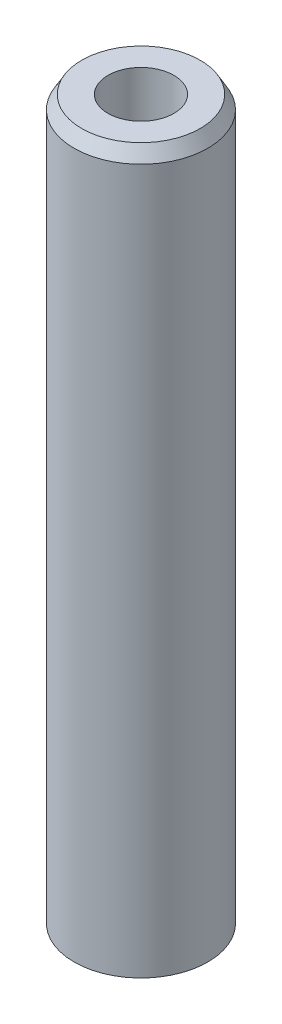
ISO-10303-21;
HEADER;
FILE_DESCRIPTION(('STEP AP214'),'2;1');
FILE_NAME('part.step','',(''),(''),'','','');
FILE_SCHEMA(('AUTOMOTIVE_DESIGN { 1 0 10303 214 1 1 1 1 }'));
ENDSEC;
DATA;
#1=APPLICATION_CONTEXT('core data for automotive mechanical design processes');
#2=APPLICATION_PROTOCOL_DEFINITION('international standard','automotive_design',2000,#1);
#3=PRODUCT_CONTEXT('',#1,'mechanical');
#4=PRODUCT('Part','Part','',(#3));
#5=PRODUCT_RELATED_PRODUCT_CATEGORY('part','',(#4));
#6=PRODUCT_DEFINITION_FORMATION('','',#4);
#7=PRODUCT_DEFINITION_CONTEXT('part definition',#1,'design');
#8=PRODUCT_DEFINITION('design','',#6,#7);
#9=PRODUCT_DEFINITION_SHAPE('','',#8);
#10=(LENGTH_UNIT() NAMED_UNIT(*) SI_UNIT(.MILLI.,.METRE.));
#11=(NAMED_UNIT(*) PLANE_ANGLE_UNIT() SI_UNIT($,.RADIAN.));
#12=(NAMED_UNIT(*) SI_UNIT($,.STERADIAN.) SOLID_ANGLE_UNIT());
#13=UNCERTAINTY_MEASURE_WITH_UNIT(LENGTH_MEASURE(1.E-05),#10,'distance_accuracy_value','');
#14=(GEOMETRIC_REPRESENTATION_CONTEXT(3) GLOBAL_UNCERTAINTY_ASSIGNED_CONTEXT((#13)) GLOBAL_UNIT_ASSIGNED_CONTEXT((#10,
#11,#12)) REPRESENTATION_CONTEXT('',''));
#15=CARTESIAN_POINT('',(0.,0.,0.));
#16=DIRECTION('',(0.,0.,1.));
#17=DIRECTION('',(1.,0.,0.));
#18=AXIS2_PLACEMENT_3D('',#15,#16,#17);
#19=CARTESIAN_POINT('',(0.,325.511131328856,0.));
#20=DIRECTION('',(0.,-1.,0.));
#21=DIRECTION('',(0.,0.,-1.));
#22=AXIS2_PLACEMENT_3D('',#19,#20,#21);
#23=CYLINDRICAL_SURFACE('',#22,30.);
#24=CARTESIAN_POINT('',(0.,319.557847297161,0.));
#25=DIRECTION('',(0.,1.,0.));
#26=DIRECTION('',(0.,0.,1.));
#27=AXIS2_PLACEMENT_3D('',#24,#25,#26);
#28=CIRCLE('',#27,30.);
#29=CARTESIAN_POINT('',(0.,319.557847297161,30.));
#30=VERTEX_POINT('',#29);
#31=EDGE_CURVE('E50',#30,#30,#28,.F.);
#32=ORIENTED_EDGE('',*,*,#31,.T.);
#33=EDGE_LOOP('',(#32));
#34=FACE_BOUND('',#33,.T.);
#35=CARTESIAN_POINT('',(0.,3.43713013826114,0.));
#36=DIRECTION('',(0.,1.,0.));
#37=DIRECTION('',(0.,0.,1.));
#38=AXIS2_PLACEMENT_3D('',#35,#36,#37);
#39=CIRCLE('',#38,30.);
#40=CARTESIAN_POINT('',(0.,3.43713013826114,30.));
#41=VERTEX_POINT('',#40);
#42=EDGE_CURVE('E51',#41,#41,#39,.T.);
#43=ORIENTED_EDGE('',*,*,#42,.T.);
#44=EDGE_LOOP('',(#43));
#45=FACE_BOUND('',#44,.T.);
#46=ADVANCED_FACE('F39',(#34,#45),#23,.T.);
#47=CARTESIAN_POINT('',(0.,325.511131328856,0.));
#48=DIRECTION('',(0.,1.,0.));
#49=DIRECTION('',(0.,0.,1.));
#50=AXIS2_PLACEMENT_3D('',#47,#48,#49);
#51=PLANE('',#50);
#52=CARTESIAN_POINT('',(0.,325.511131328856,0.));
#53=DIRECTION('',(0.,1.,0.));
#54=DIRECTION('',(0.,0.,1.));
#55=AXIS2_PLACEMENT_3D('',#52,#53,#54);
#56=CIRCLE('',#55,26.5628698617389);
#57=CARTESIAN_POINT('',(0.,325.511131328856,26.5628698617389));
#58=VERTEX_POINT('',#57);
#59=EDGE_CURVE('E54',#58,#58,#56,.T.);
#60=ORIENTED_EDGE('',*,*,#59,.T.);
#61=EDGE_LOOP('',(#60));
#62=FACE_BOUND('',#61,.T.);
#63=CARTESIAN_POINT('',(0.,325.511131328856,0.));
#64=DIRECTION('',(0.,1.,0.));
#65=DIRECTION('',(0.,0.,1.));
#66=AXIS2_PLACEMENT_3D('',#63,#64,#65);
#67=CIRCLE('',#66,14.7936327460071);
#68=CARTESIAN_POINT('',(0.,325.511131328856,14.7936327460071));
#69=VERTEX_POINT('',#68);
#70=EDGE_CURVE('E58',#69,#69,#67,.T.);
#71=ORIENTED_EDGE('',*,*,#70,.F.);
#72=EDGE_LOOP('',(#71));
#73=FACE_BOUND('',#72,.T.);
#74=ADVANCED_FACE('F69',(#62,#73),#51,.T.);
#75=CARTESIAN_POINT('',(0.,0.,0.));
#76=DIRECTION('',(0.,1.,0.));
#77=DIRECTION('',(0.,0.,1.));
#78=AXIS2_PLACEMENT_3D('',#75,#76,#77);
#79=PLANE('',#78);
#80=CARTESIAN_POINT('',(0.,0.,0.));
#81=DIRECTION('',(0.,1.,0.));
#82=DIRECTION('',(0.,0.,1.));
#83=AXIS2_PLACEMENT_3D('',#80,#81,#82);
#84=CIRCLE('',#83,24.0467159683054);
#85=CARTESIAN_POINT('',(0.,0.,24.0467159683054));
#86=VERTEX_POINT('',#85);
#87=EDGE_CURVE('E10',#86,#86,#84,.F.);
#88=ORIENTED_EDGE('',*,*,#87,.T.);
#89=EDGE_LOOP('',(#88));
#90=FACE_BOUND('',#89,.T.);
#91=CARTESIAN_POINT('',(0.,0.,0.));
#92=DIRECTION('',(0.,1.,0.));
#93=DIRECTION('',(0.,0.,1.));
#94=AXIS2_PLACEMENT_3D('',#91,#92,#93);
#95=CIRCLE('',#94,14.7936327460071);
#96=CARTESIAN_POINT('',(0.,0.,14.7936327460071));
#97=VERTEX_POINT('',#96);
#98=EDGE_CURVE('E63',#97,#97,#95,.T.);
#99=ORIENTED_EDGE('',*,*,#98,.T.);
#100=EDGE_LOOP('',(#99));
#101=FACE_BOUND('',#100,.T.);
#102=ADVANCED_FACE('F75',(#90,#101),#79,.F.);
#103=CARTESIAN_POINT('',(0.,325.511131328856,0.));
#104=DIRECTION('',(0.,-1.,0.));
#105=DIRECTION('',(0.,0.,-1.));
#106=AXIS2_PLACEMENT_3D('',#103,#104,#105);
#107=CYLINDRICAL_SURFACE('',#106,14.7936327460071);
#108=ORIENTED_EDGE('',*,*,#70,.T.);
#109=EDGE_LOOP('',(#108));
#110=FACE_BOUND('',#109,.T.);
#111=ORIENTED_EDGE('',*,*,#98,.F.);
#112=EDGE_LOOP('',(#111));
#113=FACE_BOUND('',#112,.T.);
#114=ADVANCED_FACE('F70',(#110,#113),#107,.F.);
#115=CARTESIAN_POINT('',(0.,325.511131328856,0.));
#116=DIRECTION('',(0.,-1.,0.));
#117=DIRECTION('',(0.,0.,-1.));
#118=AXIS2_PLACEMENT_3D('',#115,#116,#117);
#119=CONICAL_SURFACE('',#118,26.5628698617389,0.523598775598294);
#120=ORIENTED_EDGE('',*,*,#31,.F.);
#121=EDGE_LOOP('',(#120));
#122=FACE_BOUND('',#121,.T.);
#123=ORIENTED_EDGE('',*,*,#59,.F.);
#124=EDGE_LOOP('',(#123));
#125=FACE_BOUND('',#124,.T.);
#126=ADVANCED_FACE('F81',(#122,#125),#119,.T.);
#127=CARTESIAN_POINT('',(0.,3.43713013826114,0.));
#128=DIRECTION('',(0.,1.,0.));
#129=DIRECTION('',(0.,0.,1.));
#130=AXIS2_PLACEMENT_3D('',#127,#128,#129);
#131=CONICAL_SURFACE('',#130,30.,1.0471975511966);
#132=ORIENTED_EDGE('',*,*,#87,.F.);
#133=EDGE_LOOP('',(#132));
#134=FACE_BOUND('',#133,.T.);
#135=ORIENTED_EDGE('',*,*,#42,.F.);
#136=EDGE_LOOP('',(#135));
#137=FACE_BOUND('',#136,.T.);
#138=ADVANCED_FACE('F45',(#134,#137),#131,.T.);
#139=CLOSED_SHELL('',(#46,#74,#102,#114,#126,#138));
#140=MANIFOLD_SOLID_BREP('B2',#139);
#141=ADVANCED_BREP_SHAPE_REPRESENTATION('',(#18,#140),#14);
#142=SHAPE_DEFINITION_REPRESENTATION(#9,#141);
ENDSEC;
END-ISO-10303-21;
